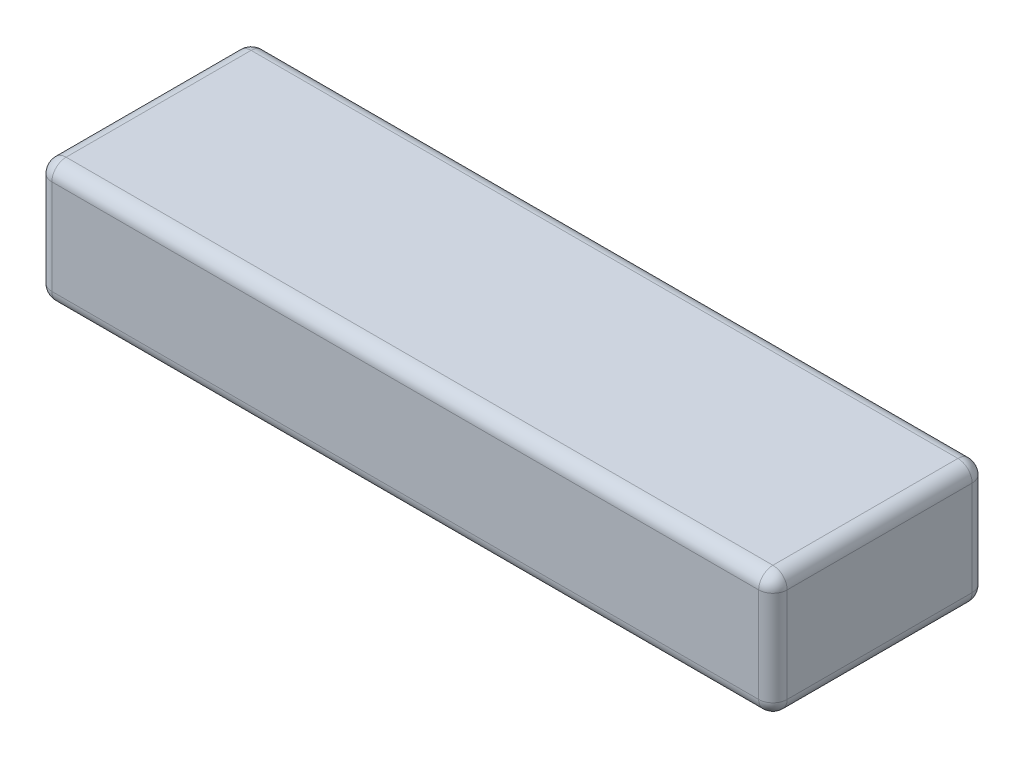
ISO-10303-21;
HEADER;
FILE_DESCRIPTION(('STEP AP214'),'2;1');
FILE_NAME('part.step','',(''),(''),'','','');
FILE_SCHEMA(('AUTOMOTIVE_DESIGN { 1 0 10303 214 1 1 1 1 }'));
ENDSEC;
DATA;
#1=APPLICATION_CONTEXT('core data for automotive mechanical design processes');
#2=APPLICATION_PROTOCOL_DEFINITION('international standard','automotive_design',2000,#1);
#3=PRODUCT_CONTEXT('',#1,'mechanical');
#4=PRODUCT('Part','Part','',(#3));
#5=PRODUCT_RELATED_PRODUCT_CATEGORY('part','',(#4));
#6=PRODUCT_DEFINITION_FORMATION('','',#4);
#7=PRODUCT_DEFINITION_CONTEXT('part definition',#1,'design');
#8=PRODUCT_DEFINITION('design','',#6,#7);
#9=PRODUCT_DEFINITION_SHAPE('','',#8);
#10=(LENGTH_UNIT() NAMED_UNIT(*) SI_UNIT(.MILLI.,.METRE.));
#11=(NAMED_UNIT(*) PLANE_ANGLE_UNIT() SI_UNIT($,.RADIAN.));
#12=(NAMED_UNIT(*) SI_UNIT($,.STERADIAN.) SOLID_ANGLE_UNIT());
#13=UNCERTAINTY_MEASURE_WITH_UNIT(LENGTH_MEASURE(1.E-05),#10,'distance_accuracy_value','');
#14=(GEOMETRIC_REPRESENTATION_CONTEXT(3) GLOBAL_UNCERTAINTY_ASSIGNED_CONTEXT((#13)) GLOBAL_UNIT_ASSIGNED_CONTEXT((#10,
#11,#12)) REPRESENTATION_CONTEXT('',''));
#15=CARTESIAN_POINT('',(0.,0.,0.));
#16=DIRECTION('',(0.,0.,1.));
#17=DIRECTION('',(1.,0.,0.));
#18=AXIS2_PLACEMENT_3D('',#15,#16,#17);
#19=CARTESIAN_POINT('',(-155.,26.,-22.5));
#20=DIRECTION('',(1.,0.,0.));
#21=DIRECTION('',(0.,0.,-1.));
#22=AXIS2_PLACEMENT_3D('',#19,#20,#21);
#23=PLANE('',#22);
#24=DIRECTION('',(0.,0.,1.));
#25=VECTOR('',#24,1.);
#26=CARTESIAN_POINT('',(-155.,23.,-22.5));
#27=LINE('',#26,#25);
#28=CARTESIAN_POINT('',(-155.,23.,19.5));
#29=VERTEX_POINT('',#28);
#30=CARTESIAN_POINT('',(-155.,23.,-19.5));
#31=VERTEX_POINT('',#30);
#32=EDGE_CURVE('E168',#29,#31,#27,.F.);
#33=ORIENTED_EDGE('',*,*,#32,.T.);
#34=DIRECTION('',(0.,-1.,0.));
#35=VECTOR('',#34,1.);
#36=CARTESIAN_POINT('',(-155.,26.,-19.5));
#37=LINE('',#36,#35);
#38=CARTESIAN_POINT('',(-155.,3.,-19.5));
#39=VERTEX_POINT('',#38);
#40=EDGE_CURVE('E142',#31,#39,#37,.T.);
#41=ORIENTED_EDGE('',*,*,#40,.T.);
#42=DIRECTION('',(0.,0.,1.));
#43=VECTOR('',#42,1.);
#44=CARTESIAN_POINT('',(-155.,3.,-22.5));
#45=LINE('',#44,#43);
#46=CARTESIAN_POINT('',(-155.,3.,19.5));
#47=VERTEX_POINT('',#46);
#48=EDGE_CURVE('E159',#39,#47,#45,.T.);
#49=ORIENTED_EDGE('',*,*,#48,.T.);
#50=DIRECTION('',(0.,-1.,0.));
#51=VECTOR('',#50,1.);
#52=CARTESIAN_POINT('',(-155.,26.,19.5));
#53=LINE('',#52,#51);
#54=EDGE_CURVE('E165',#47,#29,#53,.F.);
#55=ORIENTED_EDGE('',*,*,#54,.T.);
#56=EDGE_LOOP('',(#33,#41,#49,#55));
#57=FACE_BOUND('',#56,.T.);
#58=ADVANCED_FACE('F48',(#57),#23,.F.);
#59=CARTESIAN_POINT('',(-155.,26.,22.5));
#60=DIRECTION('',(0.,0.,-1.));
#61=DIRECTION('',(-1.,0.,0.));
#62=AXIS2_PLACEMENT_3D('',#59,#60,#61);
#63=PLANE('',#62);
#64=DIRECTION('',(1.,0.,0.));
#65=VECTOR('',#64,1.);
#66=CARTESIAN_POINT('',(-155.,23.,22.5));
#67=LINE('',#66,#65);
#68=CARTESIAN_POINT('',(-3.,23.,22.5));
#69=VERTEX_POINT('',#68);
#70=CARTESIAN_POINT('',(-152.,23.,22.5));
#71=VERTEX_POINT('',#70);
#72=EDGE_CURVE('E190',#69,#71,#67,.F.);
#73=ORIENTED_EDGE('',*,*,#72,.T.);
#74=DIRECTION('',(0.,-1.,0.));
#75=VECTOR('',#74,1.);
#76=CARTESIAN_POINT('',(-152.,26.,22.5));
#77=LINE('',#76,#75);
#78=CARTESIAN_POINT('',(-152.,3.,22.5));
#79=VERTEX_POINT('',#78);
#80=EDGE_CURVE('E196',#71,#79,#77,.T.);
#81=ORIENTED_EDGE('',*,*,#80,.T.);
#82=DIRECTION('',(1.,0.,0.));
#83=VECTOR('',#82,1.);
#84=CARTESIAN_POINT('',(-155.,3.,22.5));
#85=LINE('',#84,#83);
#86=CARTESIAN_POINT('',(-3.,3.,22.5));
#87=VERTEX_POINT('',#86);
#88=EDGE_CURVE('E194',#79,#87,#85,.T.);
#89=ORIENTED_EDGE('',*,*,#88,.T.);
#90=DIRECTION('',(0.,-1.,0.));
#91=VECTOR('',#90,1.);
#92=CARTESIAN_POINT('',(-3.,26.,22.5));
#93=LINE('',#92,#91);
#94=EDGE_CURVE('E192',#87,#69,#93,.F.);
#95=ORIENTED_EDGE('',*,*,#94,.T.);
#96=EDGE_LOOP('',(#73,#81,#89,#95));
#97=FACE_BOUND('',#96,.T.);
#98=ADVANCED_FACE('F291',(#97),#63,.F.);
#99=CARTESIAN_POINT('',(0.,26.,-22.5));
#100=DIRECTION('',(-1.,0.,0.));
#101=DIRECTION('',(0.,0.,1.));
#102=AXIS2_PLACEMENT_3D('',#99,#100,#101);
#103=PLANE('',#102);
#104=DIRECTION('',(0.,0.,-1.));
#105=VECTOR('',#104,1.);
#106=CARTESIAN_POINT('',(0.,3.,-22.5));
#107=LINE('',#106,#105);
#108=CARTESIAN_POINT('',(0.,3.,19.5));
#109=VERTEX_POINT('',#108);
#110=CARTESIAN_POINT('',(0.,3.,-19.5));
#111=VERTEX_POINT('',#110);
#112=EDGE_CURVE('E57',#109,#111,#107,.T.);
#113=ORIENTED_EDGE('',*,*,#112,.T.);
#114=DIRECTION('',(0.,-1.,0.));
#115=VECTOR('',#114,1.);
#116=CARTESIAN_POINT('',(0.,26.,-19.5));
#117=LINE('',#116,#115);
#118=CARTESIAN_POINT('',(0.,23.,-19.5));
#119=VERTEX_POINT('',#118);
#120=EDGE_CURVE('E13',#111,#119,#117,.F.);
#121=ORIENTED_EDGE('',*,*,#120,.T.);
#122=DIRECTION('',(0.,0.,-1.));
#123=VECTOR('',#122,1.);
#124=CARTESIAN_POINT('',(0.,23.,22.5));
#125=LINE('',#124,#123);
#126=CARTESIAN_POINT('',(0.,23.,19.5));
#127=VERTEX_POINT('',#126);
#128=EDGE_CURVE('E208',#119,#127,#125,.F.);
#129=ORIENTED_EDGE('',*,*,#128,.T.);
#130=DIRECTION('',(0.,-1.,0.));
#131=VECTOR('',#130,1.);
#132=CARTESIAN_POINT('',(0.,26.,19.5));
#133=LINE('',#132,#131);
#134=EDGE_CURVE('E68',#127,#109,#133,.T.);
#135=ORIENTED_EDGE('',*,*,#134,.T.);
#136=EDGE_LOOP('',(#113,#121,#129,#135));
#137=FACE_BOUND('',#136,.T.);
#138=ADVANCED_FACE('F317',(#137),#103,.F.);
#139=CARTESIAN_POINT('',(-155.,26.,-22.5));
#140=DIRECTION('',(0.,0.,1.));
#141=DIRECTION('',(1.,0.,0.));
#142=AXIS2_PLACEMENT_3D('',#139,#140,#141);
#143=PLANE('',#142);
#144=DIRECTION('',(-1.,0.,0.));
#145=VECTOR('',#144,1.);
#146=CARTESIAN_POINT('',(-155.,3.,-22.5));
#147=LINE('',#146,#145);
#148=CARTESIAN_POINT('',(-3.,3.,-22.5));
#149=VERTEX_POINT('',#148);
#150=CARTESIAN_POINT('',(-152.,3.,-22.5));
#151=VERTEX_POINT('',#150);
#152=EDGE_CURVE('E172',#149,#151,#147,.T.);
#153=ORIENTED_EDGE('',*,*,#152,.T.);
#154=DIRECTION('',(0.,-1.,0.));
#155=VECTOR('',#154,1.);
#156=CARTESIAN_POINT('',(-152.,26.,-22.5));
#157=LINE('',#156,#155);
#158=CARTESIAN_POINT('',(-152.,23.,-22.5));
#159=VERTEX_POINT('',#158);
#160=EDGE_CURVE('E144',#151,#159,#157,.F.);
#161=ORIENTED_EDGE('',*,*,#160,.T.);
#162=DIRECTION('',(-1.,0.,0.));
#163=VECTOR('',#162,1.);
#164=CARTESIAN_POINT('',(0.,23.,-22.5));
#165=LINE('',#164,#163);
#166=CARTESIAN_POINT('',(-3.,23.,-22.5));
#167=VERTEX_POINT('',#166);
#168=EDGE_CURVE('E178',#159,#167,#165,.F.);
#169=ORIENTED_EDGE('',*,*,#168,.T.);
#170=DIRECTION('',(0.,-1.,0.));
#171=VECTOR('',#170,1.);
#172=CARTESIAN_POINT('',(-3.,26.,-22.5));
#173=LINE('',#172,#171);
#174=EDGE_CURVE('E170',#167,#149,#173,.T.);
#175=ORIENTED_EDGE('',*,*,#174,.T.);
#176=EDGE_LOOP('',(#153,#161,#169,#175));
#177=FACE_BOUND('',#176,.T.);
#178=ADVANCED_FACE('F319',(#177),#143,.F.);
#179=CARTESIAN_POINT('',(0.,26.,0.));
#180=DIRECTION('',(0.,1.,0.));
#181=DIRECTION('',(0.,0.,1.));
#182=AXIS2_PLACEMENT_3D('',#179,#180,#181);
#183=PLANE('',#182);
#184=DIRECTION('',(0.,0.,-1.));
#185=VECTOR('',#184,1.);
#186=CARTESIAN_POINT('',(-3.,26.,-22.5));
#187=LINE('',#186,#185);
#188=CARTESIAN_POINT('',(-3.,26.,19.5));
#189=VERTEX_POINT('',#188);
#190=CARTESIAN_POINT('',(-3.,26.,-19.5));
#191=VERTEX_POINT('',#190);
#192=EDGE_CURVE('E183',#189,#191,#187,.T.);
#193=ORIENTED_EDGE('',*,*,#192,.T.);
#194=DIRECTION('',(-1.,0.,0.));
#195=VECTOR('',#194,1.);
#196=CARTESIAN_POINT('',(-155.,26.,-19.5));
#197=LINE('',#196,#195);
#198=CARTESIAN_POINT('',(-152.,26.,-19.5));
#199=VERTEX_POINT('',#198);
#200=EDGE_CURVE('E187',#191,#199,#197,.T.);
#201=ORIENTED_EDGE('',*,*,#200,.T.);
#202=DIRECTION('',(0.,0.,1.));
#203=VECTOR('',#202,1.);
#204=CARTESIAN_POINT('',(-152.,26.,22.5));
#205=LINE('',#204,#203);
#206=CARTESIAN_POINT('',(-152.,26.,19.5));
#207=VERTEX_POINT('',#206);
#208=EDGE_CURVE('E185',#199,#207,#205,.T.);
#209=ORIENTED_EDGE('',*,*,#208,.T.);
#210=DIRECTION('',(1.,0.,0.));
#211=VECTOR('',#210,1.);
#212=CARTESIAN_POINT('',(0.,26.,19.5));
#213=LINE('',#212,#211);
#214=EDGE_CURVE('E181',#207,#189,#213,.T.);
#215=ORIENTED_EDGE('',*,*,#214,.T.);
#216=EDGE_LOOP('',(#193,#201,#209,#215));
#217=FACE_BOUND('',#216,.T.);
#218=ADVANCED_FACE('F282',(#217),#183,.T.);
#219=CARTESIAN_POINT('',(0.,0.,0.));
#220=DIRECTION('',(0.,1.,0.));
#221=DIRECTION('',(0.,0.,1.));
#222=AXIS2_PLACEMENT_3D('',#219,#220,#221);
#223=PLANE('',#222);
#224=DIRECTION('',(0.,0.,-1.));
#225=VECTOR('',#224,1.);
#226=CARTESIAN_POINT('',(-3.,0.,0.));
#227=LINE('',#226,#225);
#228=CARTESIAN_POINT('',(-3.,0.,-19.5));
#229=VERTEX_POINT('',#228);
#230=CARTESIAN_POINT('',(-3.,0.,19.5));
#231=VERTEX_POINT('',#230);
#232=EDGE_CURVE('E199',#229,#231,#227,.F.);
#233=ORIENTED_EDGE('',*,*,#232,.T.);
#234=DIRECTION('',(1.,0.,0.));
#235=VECTOR('',#234,1.);
#236=CARTESIAN_POINT('',(0.,0.,19.5));
#237=LINE('',#236,#235);
#238=CARTESIAN_POINT('',(-152.,0.,19.5));
#239=VERTEX_POINT('',#238);
#240=EDGE_CURVE('E205',#231,#239,#237,.F.);
#241=ORIENTED_EDGE('',*,*,#240,.T.);
#242=DIRECTION('',(0.,0.,1.));
#243=VECTOR('',#242,1.);
#244=CARTESIAN_POINT('',(-152.,0.,0.));
#245=LINE('',#244,#243);
#246=CARTESIAN_POINT('',(-152.,0.,-19.5));
#247=VERTEX_POINT('',#246);
#248=EDGE_CURVE('E203',#239,#247,#245,.F.);
#249=ORIENTED_EDGE('',*,*,#248,.T.);
#250=DIRECTION('',(-1.,0.,0.));
#251=VECTOR('',#250,1.);
#252=CARTESIAN_POINT('',(0.,0.,-19.5));
#253=LINE('',#252,#251);
#254=EDGE_CURVE('E201',#247,#229,#253,.F.);
#255=ORIENTED_EDGE('',*,*,#254,.T.);
#256=EDGE_LOOP('',(#233,#241,#249,#255));
#257=FACE_BOUND('',#256,.T.);
#258=ADVANCED_FACE('F385',(#257),#223,.F.);
#259=CARTESIAN_POINT('',(-3.,26.,19.5));
#260=DIRECTION('',(0.,-1.,0.));
#261=DIRECTION('',(0.,0.,-1.));
#262=AXIS2_PLACEMENT_3D('',#259,#260,#261);
#263=CYLINDRICAL_SURFACE('',#262,3.);
#264=CARTESIAN_POINT('',(-3.,23.,19.5));
#265=DIRECTION('',(0.,1.,0.));
#266=DIRECTION('',(0.,0.,1.));
#267=AXIS2_PLACEMENT_3D('',#264,#265,#266);
#268=CIRCLE('',#267,3.);
#269=EDGE_CURVE('E52',#69,#127,#268,.T.);
#270=ORIENTED_EDGE('',*,*,#269,.F.);
#271=ORIENTED_EDGE('',*,*,#94,.F.);
#272=CARTESIAN_POINT('',(-3.,3.,19.5));
#273=DIRECTION('',(0.,-1.,0.));
#274=DIRECTION('',(0.,0.,-1.));
#275=AXIS2_PLACEMENT_3D('',#272,#273,#274);
#276=CIRCLE('',#275,3.);
#277=EDGE_CURVE('E261',#109,#87,#276,.T.);
#278=ORIENTED_EDGE('',*,*,#277,.F.);
#279=ORIENTED_EDGE('',*,*,#134,.F.);
#280=EDGE_LOOP('',(#270,#271,#278,#279));
#281=FACE_BOUND('',#280,.T.);
#282=ADVANCED_FACE('F50',(#281),#263,.T.);
#283=CARTESIAN_POINT('',(-3.,23.,19.5));
#284=DIRECTION('',(0.,0.,1.));
#285=DIRECTION('',(1.,0.,0.));
#286=AXIS2_PLACEMENT_3D('',#283,#284,#285);
#287=SPHERICAL_SURFACE('',#286,3.);
#288=CARTESIAN_POINT('',(-3.,23.,19.5));
#289=DIRECTION('',(1.,0.,0.));
#290=DIRECTION('',(0.,0.,-1.));
#291=AXIS2_PLACEMENT_3D('',#288,#289,#290);
#292=CIRCLE('',#291,3.);
#293=EDGE_CURVE('E256',#69,#189,#292,.F.);
#294=ORIENTED_EDGE('',*,*,#293,.F.);
#295=ORIENTED_EDGE('',*,*,#269,.T.);
#296=CARTESIAN_POINT('',(-3.,23.,19.5));
#297=DIRECTION('',(0.,0.,1.));
#298=DIRECTION('',(0.,-1.,0.));
#299=AXIS2_PLACEMENT_3D('',#296,#297,#298);
#300=CIRCLE('',#299,3.);
#301=EDGE_CURVE('E259',#189,#127,#300,.F.);
#302=ORIENTED_EDGE('',*,*,#301,.F.);
#303=EDGE_LOOP('',(#294,#295,#302));
#304=FACE_BOUND('',#303,.T.);
#305=ADVANCED_FACE('F271',(#304),#287,.T.);
#306=CARTESIAN_POINT('',(-3.,3.,19.5));
#307=DIRECTION('',(0.,0.,1.));
#308=DIRECTION('',(1.,0.,0.));
#309=AXIS2_PLACEMENT_3D('',#306,#307,#308);
#310=SPHERICAL_SURFACE('',#309,3.);
#311=CARTESIAN_POINT('',(-3.,3.,19.5));
#312=DIRECTION('',(0.,0.,1.));
#313=DIRECTION('',(1.,0.,0.));
#314=AXIS2_PLACEMENT_3D('',#311,#312,#313);
#315=CIRCLE('',#314,3.);
#316=EDGE_CURVE('E250',#109,#231,#315,.F.);
#317=ORIENTED_EDGE('',*,*,#316,.F.);
#318=ORIENTED_EDGE('',*,*,#277,.T.);
#319=CARTESIAN_POINT('',(-3.,3.,19.5));
#320=DIRECTION('',(1.,0.,0.));
#321=DIRECTION('',(0.,0.,-1.));
#322=AXIS2_PLACEMENT_3D('',#319,#320,#321);
#323=CIRCLE('',#322,3.);
#324=EDGE_CURVE('E253',#231,#87,#323,.F.);
#325=ORIENTED_EDGE('',*,*,#324,.F.);
#326=EDGE_LOOP('',(#317,#318,#325));
#327=FACE_BOUND('',#326,.T.);
#328=ADVANCED_FACE('F303',(#327),#310,.T.);
#329=CARTESIAN_POINT('',(-3.,23.,0.));
#330=DIRECTION('',(0.,0.,1.));
#331=DIRECTION('',(1.,0.,0.));
#332=AXIS2_PLACEMENT_3D('',#329,#330,#331);
#333=CYLINDRICAL_SURFACE('',#332,3.);
#334=ORIENTED_EDGE('',*,*,#301,.T.);
#335=ORIENTED_EDGE('',*,*,#128,.F.);
#336=CARTESIAN_POINT('',(-3.,23.,-19.5));
#337=DIRECTION('',(0.,0.,-1.));
#338=DIRECTION('',(-1.,0.,0.));
#339=AXIS2_PLACEMENT_3D('',#336,#337,#338);
#340=CIRCLE('',#339,3.);
#341=EDGE_CURVE('E245',#191,#119,#340,.T.);
#342=ORIENTED_EDGE('',*,*,#341,.F.);
#343=ORIENTED_EDGE('',*,*,#192,.F.);
#344=EDGE_LOOP('',(#334,#335,#342,#343));
#345=FACE_BOUND('',#344,.T.);
#346=ADVANCED_FACE('F278',(#345),#333,.T.);
#347=CARTESIAN_POINT('',(0.,23.,19.5));
#348=DIRECTION('',(-1.,0.,0.));
#349=DIRECTION('',(0.,0.,1.));
#350=AXIS2_PLACEMENT_3D('',#347,#348,#349);
#351=CYLINDRICAL_SURFACE('',#350,3.);
#352=ORIENTED_EDGE('',*,*,#293,.T.);
#353=ORIENTED_EDGE('',*,*,#214,.F.);
#354=CARTESIAN_POINT('',(-152.,23.,19.5));
#355=DIRECTION('',(-1.,0.,0.));
#356=DIRECTION('',(0.,0.,1.));
#357=AXIS2_PLACEMENT_3D('',#354,#355,#356);
#358=CIRCLE('',#357,3.);
#359=EDGE_CURVE('E242',#71,#207,#358,.T.);
#360=ORIENTED_EDGE('',*,*,#359,.F.);
#361=ORIENTED_EDGE('',*,*,#72,.F.);
#362=EDGE_LOOP('',(#352,#353,#360,#361));
#363=FACE_BOUND('',#362,.T.);
#364=ADVANCED_FACE('F288',(#363),#351,.T.);
#365=CARTESIAN_POINT('',(-152.,26.,19.5));
#366=DIRECTION('',(0.,-1.,0.));
#367=DIRECTION('',(0.,0.,-1.));
#368=AXIS2_PLACEMENT_3D('',#365,#366,#367);
#369=CYLINDRICAL_SURFACE('',#368,3.);
#370=CARTESIAN_POINT('',(-152.,3.,19.5));
#371=DIRECTION('',(0.,-1.,0.));
#372=DIRECTION('',(0.,0.,-1.));
#373=AXIS2_PLACEMENT_3D('',#370,#371,#372);
#374=CIRCLE('',#373,3.);
#375=EDGE_CURVE('E236',#79,#47,#374,.T.);
#376=ORIENTED_EDGE('',*,*,#375,.F.);
#377=ORIENTED_EDGE('',*,*,#80,.F.);
#378=CARTESIAN_POINT('',(-152.,23.,19.5));
#379=DIRECTION('',(0.,1.,0.));
#380=DIRECTION('',(0.,0.,1.));
#381=AXIS2_PLACEMENT_3D('',#378,#379,#380);
#382=CIRCLE('',#381,3.);
#383=EDGE_CURVE('E239',#29,#71,#382,.T.);
#384=ORIENTED_EDGE('',*,*,#383,.F.);
#385=ORIENTED_EDGE('',*,*,#54,.F.);
#386=EDGE_LOOP('',(#376,#377,#384,#385));
#387=FACE_BOUND('',#386,.T.);
#388=ADVANCED_FACE('F295',(#387),#369,.T.);
#389=CARTESIAN_POINT('',(-155.,3.,19.5));
#390=DIRECTION('',(1.,0.,0.));
#391=DIRECTION('',(0.,0.,-1.));
#392=AXIS2_PLACEMENT_3D('',#389,#390,#391);
#393=CYLINDRICAL_SURFACE('',#392,3.);
#394=ORIENTED_EDGE('',*,*,#324,.T.);
#395=ORIENTED_EDGE('',*,*,#88,.F.);
#396=CARTESIAN_POINT('',(-152.,3.,19.5));
#397=DIRECTION('',(-1.,0.,0.));
#398=DIRECTION('',(0.,0.,1.));
#399=AXIS2_PLACEMENT_3D('',#396,#397,#398);
#400=CIRCLE('',#399,3.);
#401=EDGE_CURVE('E234',#239,#79,#400,.T.);
#402=ORIENTED_EDGE('',*,*,#401,.F.);
#403=ORIENTED_EDGE('',*,*,#240,.F.);
#404=EDGE_LOOP('',(#394,#395,#402,#403));
#405=FACE_BOUND('',#404,.T.);
#406=ADVANCED_FACE('F301',(#405),#393,.T.);
#407=CARTESIAN_POINT('',(-3.,3.,-22.5));
#408=DIRECTION('',(0.,0.,-1.));
#409=DIRECTION('',(-1.,0.,0.));
#410=AXIS2_PLACEMENT_3D('',#407,#408,#409);
#411=CYLINDRICAL_SURFACE('',#410,3.);
#412=ORIENTED_EDGE('',*,*,#316,.T.);
#413=ORIENTED_EDGE('',*,*,#232,.F.);
#414=CARTESIAN_POINT('',(-3.,3.,-19.5));
#415=DIRECTION('',(0.,0.,-1.));
#416=DIRECTION('',(-1.,0.,0.));
#417=AXIS2_PLACEMENT_3D('',#414,#415,#416);
#418=CIRCLE('',#417,3.);
#419=EDGE_CURVE('E231',#111,#229,#418,.T.);
#420=ORIENTED_EDGE('',*,*,#419,.F.);
#421=ORIENTED_EDGE('',*,*,#112,.F.);
#422=EDGE_LOOP('',(#412,#413,#420,#421));
#423=FACE_BOUND('',#422,.T.);
#424=ADVANCED_FACE('F307',(#423),#411,.T.);
#425=CARTESIAN_POINT('',(-3.,26.,-19.5));
#426=DIRECTION('',(0.,-1.,0.));
#427=DIRECTION('',(0.,0.,-1.));
#428=AXIS2_PLACEMENT_3D('',#425,#426,#427);
#429=CYLINDRICAL_SURFACE('',#428,3.);
#430=CARTESIAN_POINT('',(-3.,23.,-19.5));
#431=DIRECTION('',(0.,1.,0.));
#432=DIRECTION('',(0.,0.,1.));
#433=AXIS2_PLACEMENT_3D('',#430,#431,#432);
#434=CIRCLE('',#433,3.);
#435=EDGE_CURVE('E247',#119,#167,#434,.T.);
#436=ORIENTED_EDGE('',*,*,#435,.F.);
#437=ORIENTED_EDGE('',*,*,#120,.F.);
#438=CARTESIAN_POINT('',(-3.,3.,-19.5));
#439=DIRECTION('',(0.,-1.,0.));
#440=DIRECTION('',(0.,0.,-1.));
#441=AXIS2_PLACEMENT_3D('',#438,#439,#440);
#442=CIRCLE('',#441,3.);
#443=EDGE_CURVE('E228',#149,#111,#442,.T.);
#444=ORIENTED_EDGE('',*,*,#443,.F.);
#445=ORIENTED_EDGE('',*,*,#174,.F.);
#446=EDGE_LOOP('',(#436,#437,#444,#445));
#447=FACE_BOUND('',#446,.T.);
#448=ADVANCED_FACE('F316',(#447),#429,.T.);
#449=CARTESIAN_POINT('',(-3.,23.,-19.5));
#450=DIRECTION('',(0.,0.,1.));
#451=DIRECTION('',(1.,0.,0.));
#452=AXIS2_PLACEMENT_3D('',#449,#450,#451);
#453=SPHERICAL_SURFACE('',#452,3.);
#454=ORIENTED_EDGE('',*,*,#341,.T.);
#455=ORIENTED_EDGE('',*,*,#435,.T.);
#456=CARTESIAN_POINT('',(-3.,23.,-19.5));
#457=DIRECTION('',(1.,0.,0.));
#458=DIRECTION('',(0.,1.,0.));
#459=AXIS2_PLACEMENT_3D('',#456,#457,#458);
#460=CIRCLE('',#459,3.);
#461=EDGE_CURVE('E225',#191,#167,#460,.F.);
#462=ORIENTED_EDGE('',*,*,#461,.F.);
#463=EDGE_LOOP('',(#454,#455,#462));
#464=FACE_BOUND('',#463,.T.);
#465=ADVANCED_FACE('F363',(#464),#453,.T.);
#466=CARTESIAN_POINT('',(-152.,23.,19.5));
#467=DIRECTION('',(0.,0.,1.));
#468=DIRECTION('',(1.,0.,0.));
#469=AXIS2_PLACEMENT_3D('',#466,#467,#468);
#470=SPHERICAL_SURFACE('',#469,3.);
#471=ORIENTED_EDGE('',*,*,#383,.T.);
#472=ORIENTED_EDGE('',*,*,#359,.T.);
#473=CARTESIAN_POINT('',(-152.,23.,19.5));
#474=DIRECTION('',(0.,0.,1.));
#475=DIRECTION('',(1.,0.,0.));
#476=AXIS2_PLACEMENT_3D('',#473,#474,#475);
#477=CIRCLE('',#476,3.);
#478=EDGE_CURVE('E222',#29,#207,#477,.F.);
#479=ORIENTED_EDGE('',*,*,#478,.F.);
#480=EDGE_LOOP('',(#471,#472,#479));
#481=FACE_BOUND('',#480,.T.);
#482=ADVANCED_FACE('F360',(#481),#470,.T.);
#483=CARTESIAN_POINT('',(-152.,3.,19.5));
#484=DIRECTION('',(0.,0.,1.));
#485=DIRECTION('',(1.,0.,0.));
#486=AXIS2_PLACEMENT_3D('',#483,#484,#485);
#487=SPHERICAL_SURFACE('',#486,3.);
#488=ORIENTED_EDGE('',*,*,#401,.T.);
#489=ORIENTED_EDGE('',*,*,#375,.T.);
#490=CARTESIAN_POINT('',(-152.,3.,19.5));
#491=DIRECTION('',(0.,0.,1.));
#492=DIRECTION('',(1.,0.,0.));
#493=AXIS2_PLACEMENT_3D('',#490,#491,#492);
#494=CIRCLE('',#493,3.);
#495=EDGE_CURVE('E162',#239,#47,#494,.F.);
#496=ORIENTED_EDGE('',*,*,#495,.F.);
#497=EDGE_LOOP('',(#488,#489,#496));
#498=FACE_BOUND('',#497,.T.);
#499=ADVANCED_FACE('F357',(#498),#487,.T.);
#500=CARTESIAN_POINT('',(-3.,3.,-19.5));
#501=DIRECTION('',(0.,0.,1.));
#502=DIRECTION('',(1.,0.,0.));
#503=AXIS2_PLACEMENT_3D('',#500,#501,#502);
#504=SPHERICAL_SURFACE('',#503,3.);
#505=ORIENTED_EDGE('',*,*,#443,.T.);
#506=ORIENTED_EDGE('',*,*,#419,.T.);
#507=CARTESIAN_POINT('',(-3.,3.,-19.5));
#508=DIRECTION('',(1.,0.,0.));
#509=DIRECTION('',(0.,0.,-1.));
#510=AXIS2_PLACEMENT_3D('',#507,#508,#509);
#511=CIRCLE('',#510,3.);
#512=EDGE_CURVE('E218',#149,#229,#511,.F.);
#513=ORIENTED_EDGE('',*,*,#512,.F.);
#514=EDGE_LOOP('',(#505,#506,#513));
#515=FACE_BOUND('',#514,.T.);
#516=ADVANCED_FACE('F311',(#515),#504,.T.);
#517=CARTESIAN_POINT('',(0.,23.,-19.5));
#518=DIRECTION('',(1.,0.,0.));
#519=DIRECTION('',(0.,0.,-1.));
#520=AXIS2_PLACEMENT_3D('',#517,#518,#519);
#521=CYLINDRICAL_SURFACE('',#520,3.);
#522=ORIENTED_EDGE('',*,*,#461,.T.);
#523=ORIENTED_EDGE('',*,*,#168,.F.);
#524=CARTESIAN_POINT('',(-152.,23.,-19.5));
#525=DIRECTION('',(-1.,0.,0.));
#526=DIRECTION('',(0.,0.,1.));
#527=AXIS2_PLACEMENT_3D('',#524,#525,#526);
#528=CIRCLE('',#527,3.);
#529=EDGE_CURVE('E215',#199,#159,#528,.T.);
#530=ORIENTED_EDGE('',*,*,#529,.F.);
#531=ORIENTED_EDGE('',*,*,#200,.F.);
#532=EDGE_LOOP('',(#522,#523,#530,#531));
#533=FACE_BOUND('',#532,.T.);
#534=ADVANCED_FACE('F350',(#533),#521,.T.);
#535=CARTESIAN_POINT('',(-152.,23.,0.));
#536=DIRECTION('',(0.,0.,-1.));
#537=DIRECTION('',(-1.,0.,0.));
#538=AXIS2_PLACEMENT_3D('',#535,#536,#537);
#539=CYLINDRICAL_SURFACE('',#538,3.);
#540=ORIENTED_EDGE('',*,*,#478,.T.);
#541=ORIENTED_EDGE('',*,*,#208,.F.);
#542=CARTESIAN_POINT('',(-152.,23.,-19.5));
#543=DIRECTION('',(0.,0.,-1.));
#544=DIRECTION('',(-1.,0.,0.));
#545=AXIS2_PLACEMENT_3D('',#542,#543,#544);
#546=CIRCLE('',#545,3.);
#547=EDGE_CURVE('E156',#31,#199,#546,.T.);
#548=ORIENTED_EDGE('',*,*,#547,.F.);
#549=ORIENTED_EDGE('',*,*,#32,.F.);
#550=EDGE_LOOP('',(#540,#541,#548,#549));
#551=FACE_BOUND('',#550,.T.);
#552=ADVANCED_FACE('F347',(#551),#539,.T.);
#553=CARTESIAN_POINT('',(-152.,3.,-22.5));
#554=DIRECTION('',(0.,0.,1.));
#555=DIRECTION('',(1.,0.,0.));
#556=AXIS2_PLACEMENT_3D('',#553,#554,#555);
#557=CYLINDRICAL_SURFACE('',#556,3.);
#558=ORIENTED_EDGE('',*,*,#495,.T.);
#559=ORIENTED_EDGE('',*,*,#48,.F.);
#560=CARTESIAN_POINT('',(-152.,3.,-19.5));
#561=DIRECTION('',(0.,0.,-1.));
#562=DIRECTION('',(-1.,0.,0.));
#563=AXIS2_PLACEMENT_3D('',#560,#561,#562);
#564=CIRCLE('',#563,3.);
#565=EDGE_CURVE('E150',#247,#39,#564,.T.);
#566=ORIENTED_EDGE('',*,*,#565,.F.);
#567=ORIENTED_EDGE('',*,*,#248,.F.);
#568=EDGE_LOOP('',(#558,#559,#566,#567));
#569=FACE_BOUND('',#568,.T.);
#570=ADVANCED_FACE('F160',(#569),#557,.T.);
#571=CARTESIAN_POINT('',(-155.,3.,-19.5));
#572=DIRECTION('',(-1.,0.,0.));
#573=DIRECTION('',(0.,0.,1.));
#574=AXIS2_PLACEMENT_3D('',#571,#572,#573);
#575=CYLINDRICAL_SURFACE('',#574,3.);
#576=ORIENTED_EDGE('',*,*,#512,.T.);
#577=ORIENTED_EDGE('',*,*,#254,.F.);
#578=CARTESIAN_POINT('',(-152.,3.,-19.5));
#579=DIRECTION('',(-1.,0.,0.));
#580=DIRECTION('',(0.,0.,1.));
#581=AXIS2_PLACEMENT_3D('',#578,#579,#580);
#582=CIRCLE('',#581,3.);
#583=EDGE_CURVE('E154',#151,#247,#582,.T.);
#584=ORIENTED_EDGE('',*,*,#583,.F.);
#585=ORIENTED_EDGE('',*,*,#152,.F.);
#586=EDGE_LOOP('',(#576,#577,#584,#585));
#587=FACE_BOUND('',#586,.T.);
#588=ADVANCED_FACE('F340',(#587),#575,.T.);
#589=CARTESIAN_POINT('',(-152.,23.,-19.5));
#590=DIRECTION('',(0.,0.,1.));
#591=DIRECTION('',(1.,0.,0.));
#592=AXIS2_PLACEMENT_3D('',#589,#590,#591);
#593=SPHERICAL_SURFACE('',#592,3.);
#594=ORIENTED_EDGE('',*,*,#547,.T.);
#595=ORIENTED_EDGE('',*,*,#529,.T.);
#596=CARTESIAN_POINT('',(-152.,23.,-19.5));
#597=DIRECTION('',(0.,1.,0.));
#598=DIRECTION('',(0.,0.,1.));
#599=AXIS2_PLACEMENT_3D('',#596,#597,#598);
#600=CIRCLE('',#599,3.);
#601=EDGE_CURVE('E147',#31,#159,#600,.F.);
#602=ORIENTED_EDGE('',*,*,#601,.F.);
#603=EDGE_LOOP('',(#594,#595,#602));
#604=FACE_BOUND('',#603,.T.);
#605=ADVANCED_FACE('F337',(#604),#593,.T.);
#606=CARTESIAN_POINT('',(-152.,3.,-19.5));
#607=DIRECTION('',(0.,0.,1.));
#608=DIRECTION('',(1.,0.,0.));
#609=AXIS2_PLACEMENT_3D('',#606,#607,#608);
#610=SPHERICAL_SURFACE('',#609,3.);
#611=ORIENTED_EDGE('',*,*,#583,.T.);
#612=ORIENTED_EDGE('',*,*,#565,.T.);
#613=CARTESIAN_POINT('',(-152.,3.,-19.5));
#614=DIRECTION('',(0.,-1.,0.));
#615=DIRECTION('',(0.,0.,-1.));
#616=AXIS2_PLACEMENT_3D('',#613,#614,#615);
#617=CIRCLE('',#616,3.);
#618=EDGE_CURVE('E138',#151,#39,#617,.F.);
#619=ORIENTED_EDGE('',*,*,#618,.F.);
#620=EDGE_LOOP('',(#611,#612,#619));
#621=FACE_BOUND('',#620,.T.);
#622=ADVANCED_FACE('F152',(#621),#610,.T.);
#623=CARTESIAN_POINT('',(-152.,26.,-19.5));
#624=DIRECTION('',(0.,-1.,0.));
#625=DIRECTION('',(0.,0.,-1.));
#626=AXIS2_PLACEMENT_3D('',#623,#624,#625);
#627=CYLINDRICAL_SURFACE('',#626,3.);
#628=ORIENTED_EDGE('',*,*,#601,.T.);
#629=ORIENTED_EDGE('',*,*,#160,.F.);
#630=ORIENTED_EDGE('',*,*,#618,.T.);
#631=ORIENTED_EDGE('',*,*,#40,.F.);
#632=EDGE_LOOP('',(#628,#629,#630,#631));
#633=FACE_BOUND('',#632,.T.);
#634=ADVANCED_FACE('F140',(#633),#627,.T.);
#635=CLOSED_SHELL('',(#58,#98,#138,#178,#218,#258,#282,#305,#328,#346,#364,#388,#406,#424,#448,
#465,#482,#499,#516,#534,#552,#570,#588,#605,#622,#634));
#636=MANIFOLD_SOLID_BREP('B2',#635);
#637=ADVANCED_BREP_SHAPE_REPRESENTATION('',(#18,#636),#14);
#638=SHAPE_DEFINITION_REPRESENTATION(#9,#637);
ENDSEC;
END-ISO-10303-21;
